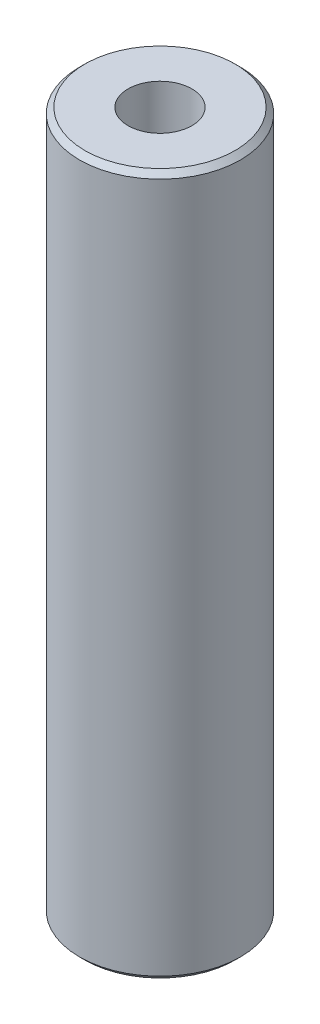
ISO-10303-21;
HEADER;
FILE_DESCRIPTION(('STEP AP214'),'2;1');
FILE_NAME('part.step','',(''),(''),'','','');
FILE_SCHEMA(('AUTOMOTIVE_DESIGN { 1 0 10303 214 1 1 1 1 }'));
ENDSEC;
DATA;
#1=APPLICATION_CONTEXT('core data for automotive mechanical design processes');
#2=APPLICATION_PROTOCOL_DEFINITION('international standard','automotive_design',2000,#1);
#3=PRODUCT_CONTEXT('',#1,'mechanical');
#4=PRODUCT('Part','Part','',(#3));
#5=PRODUCT_RELATED_PRODUCT_CATEGORY('part','',(#4));
#6=PRODUCT_DEFINITION_FORMATION('','',#4);
#7=PRODUCT_DEFINITION_CONTEXT('part definition',#1,'design');
#8=PRODUCT_DEFINITION('design','',#6,#7);
#9=PRODUCT_DEFINITION_SHAPE('','',#8);
#10=(LENGTH_UNIT() NAMED_UNIT(*) SI_UNIT(.MILLI.,.METRE.));
#11=(NAMED_UNIT(*) PLANE_ANGLE_UNIT() SI_UNIT($,.RADIAN.));
#12=(NAMED_UNIT(*) SI_UNIT($,.STERADIAN.) SOLID_ANGLE_UNIT());
#13=UNCERTAINTY_MEASURE_WITH_UNIT(LENGTH_MEASURE(1.E-05),#10,'distance_accuracy_value','');
#14=(GEOMETRIC_REPRESENTATION_CONTEXT(3) GLOBAL_UNCERTAINTY_ASSIGNED_CONTEXT((#13)) GLOBAL_UNIT_ASSIGNED_CONTEXT((#10,
#11,#12)) REPRESENTATION_CONTEXT('',''));
#15=CARTESIAN_POINT('',(0.,0.,0.));
#16=DIRECTION('',(0.,0.,1.));
#17=DIRECTION('',(1.,0.,0.));
#18=AXIS2_PLACEMENT_3D('',#15,#16,#17);
#19=CARTESIAN_POINT('',(0.,522.785871984641,0.));
#20=DIRECTION('',(0.,-1.,0.));
#21=DIRECTION('',(0.,0.,-1.));
#22=AXIS2_PLACEMENT_3D('',#19,#20,#21);
#23=CYLINDRICAL_SURFACE('',#22,60.);
#24=CARTESIAN_POINT('',(0.,518.755100475606,0.));
#25=DIRECTION('',(0.,1.,0.));
#26=DIRECTION('',(0.,0.,1.));
#27=AXIS2_PLACEMENT_3D('',#24,#25,#26);
#28=CIRCLE('',#27,60.);
#29=CARTESIAN_POINT('',(0.,518.755100475606,60.));
#30=VERTEX_POINT('',#29);
#31=EDGE_CURVE('E50',#30,#30,#28,.F.);
#32=ORIENTED_EDGE('',*,*,#31,.T.);
#33=EDGE_LOOP('',(#32));
#34=FACE_BOUND('',#33,.T.);
#35=CARTESIAN_POINT('',(0.,4.0307715090353,0.));
#36=DIRECTION('',(0.,1.,0.));
#37=DIRECTION('',(0.,0.,1.));
#38=AXIS2_PLACEMENT_3D('',#35,#36,#37);
#39=CIRCLE('',#38,60.);
#40=CARTESIAN_POINT('',(0.,4.0307715090353,60.));
#41=VERTEX_POINT('',#40);
#42=EDGE_CURVE('E51',#41,#41,#39,.T.);
#43=ORIENTED_EDGE('',*,*,#42,.T.);
#44=EDGE_LOOP('',(#43));
#45=FACE_BOUND('',#44,.T.);
#46=ADVANCED_FACE('F39',(#34,#45),#23,.T.);
#47=CARTESIAN_POINT('',(0.,522.785871984641,0.));
#48=DIRECTION('',(0.,1.,0.));
#49=DIRECTION('',(0.,0.,1.));
#50=AXIS2_PLACEMENT_3D('',#47,#48,#49);
#51=PLANE('',#50);
#52=CARTESIAN_POINT('',(0.,522.785871984641,0.));
#53=DIRECTION('',(0.,1.,0.));
#54=DIRECTION('',(0.,0.,1.));
#55=AXIS2_PLACEMENT_3D('',#52,#53,#54);
#56=CIRCLE('',#55,55.9692284909647);
#57=CARTESIAN_POINT('',(0.,522.785871984641,55.9692284909647));
#58=VERTEX_POINT('',#57);
#59=EDGE_CURVE('E54',#58,#58,#56,.T.);
#60=ORIENTED_EDGE('',*,*,#59,.T.);
#61=EDGE_LOOP('',(#60));
#62=FACE_BOUND('',#61,.T.);
#63=CARTESIAN_POINT('',(0.,522.785871984641,0.));
#64=DIRECTION('',(0.,1.,0.));
#65=DIRECTION('',(0.,0.,1.));
#66=AXIS2_PLACEMENT_3D('',#63,#64,#65);
#67=CIRCLE('',#66,23.8123521507985);
#68=CARTESIAN_POINT('',(0.,522.785871984641,23.8123521507985));
#69=VERTEX_POINT('',#68);
#70=EDGE_CURVE('E58',#69,#69,#67,.T.);
#71=ORIENTED_EDGE('',*,*,#70,.F.);
#72=EDGE_LOOP('',(#71));
#73=FACE_BOUND('',#72,.T.);
#74=ADVANCED_FACE('F69',(#62,#73),#51,.T.);
#75=CARTESIAN_POINT('',(0.,0.,0.));
#76=DIRECTION('',(0.,1.,0.));
#77=DIRECTION('',(0.,0.,1.));
#78=AXIS2_PLACEMENT_3D('',#75,#76,#77);
#79=PLANE('',#78);
#80=CARTESIAN_POINT('',(0.,0.,0.));
#81=DIRECTION('',(0.,1.,0.));
#82=DIRECTION('',(0.,0.,1.));
#83=AXIS2_PLACEMENT_3D('',#80,#81,#82);
#84=CIRCLE('',#83,55.9692284909646);
#85=CARTESIAN_POINT('',(0.,0.,55.9692284909646));
#86=VERTEX_POINT('',#85);
#87=EDGE_CURVE('E10',#86,#86,#84,.F.);
#88=ORIENTED_EDGE('',*,*,#87,.T.);
#89=EDGE_LOOP('',(#88));
#90=FACE_BOUND('',#89,.T.);
#91=CARTESIAN_POINT('',(0.,0.,0.));
#92=DIRECTION('',(0.,1.,0.));
#93=DIRECTION('',(0.,0.,1.));
#94=AXIS2_PLACEMENT_3D('',#91,#92,#93);
#95=CIRCLE('',#94,23.8123521507985);
#96=CARTESIAN_POINT('',(0.,0.,23.8123521507985));
#97=VERTEX_POINT('',#96);
#98=EDGE_CURVE('E63',#97,#97,#95,.T.);
#99=ORIENTED_EDGE('',*,*,#98,.T.);
#100=EDGE_LOOP('',(#99));
#101=FACE_BOUND('',#100,.T.);
#102=ADVANCED_FACE('F75',(#90,#101),#79,.F.);
#103=CARTESIAN_POINT('',(0.,522.785871984641,0.));
#104=DIRECTION('',(0.,-1.,0.));
#105=DIRECTION('',(0.,0.,-1.));
#106=AXIS2_PLACEMENT_3D('',#103,#104,#105);
#107=CYLINDRICAL_SURFACE('',#106,23.8123521507985);
#108=ORIENTED_EDGE('',*,*,#70,.T.);
#109=EDGE_LOOP('',(#108));
#110=FACE_BOUND('',#109,.T.);
#111=ORIENTED_EDGE('',*,*,#98,.F.);
#112=EDGE_LOOP('',(#111));
#113=FACE_BOUND('',#112,.T.);
#114=ADVANCED_FACE('F70',(#110,#113),#107,.F.);
#115=CARTESIAN_POINT('',(0.,522.785871984641,0.));
#116=DIRECTION('',(0.,-1.,0.));
#117=DIRECTION('',(0.,0.,-1.));
#118=AXIS2_PLACEMENT_3D('',#115,#116,#117);
#119=CONICAL_SURFACE('',#118,55.9692284909647,0.785398163397448);
#120=ORIENTED_EDGE('',*,*,#31,.F.);
#121=EDGE_LOOP('',(#120));
#122=FACE_BOUND('',#121,.T.);
#123=ORIENTED_EDGE('',*,*,#59,.F.);
#124=EDGE_LOOP('',(#123));
#125=FACE_BOUND('',#124,.T.);
#126=ADVANCED_FACE('F81',(#122,#125),#119,.T.);
#127=CARTESIAN_POINT('',(0.,4.0307715090353,0.));
#128=DIRECTION('',(0.,1.,0.));
#129=DIRECTION('',(0.,0.,1.));
#130=AXIS2_PLACEMENT_3D('',#127,#128,#129);
#131=CONICAL_SURFACE('',#130,60.,0.785398163397462);
#132=ORIENTED_EDGE('',*,*,#87,.F.);
#133=EDGE_LOOP('',(#132));
#134=FACE_BOUND('',#133,.T.);
#135=ORIENTED_EDGE('',*,*,#42,.F.);
#136=EDGE_LOOP('',(#135));
#137=FACE_BOUND('',#136,.T.);
#138=ADVANCED_FACE('F45',(#134,#137),#131,.T.);
#139=CLOSED_SHELL('',(#46,#74,#102,#114,#126,#138));
#140=MANIFOLD_SOLID_BREP('B2',#139);
#141=ADVANCED_BREP_SHAPE_REPRESENTATION('',(#18,#140),#14);
#142=SHAPE_DEFINITION_REPRESENTATION(#9,#141);
ENDSEC;
END-ISO-10303-21;
